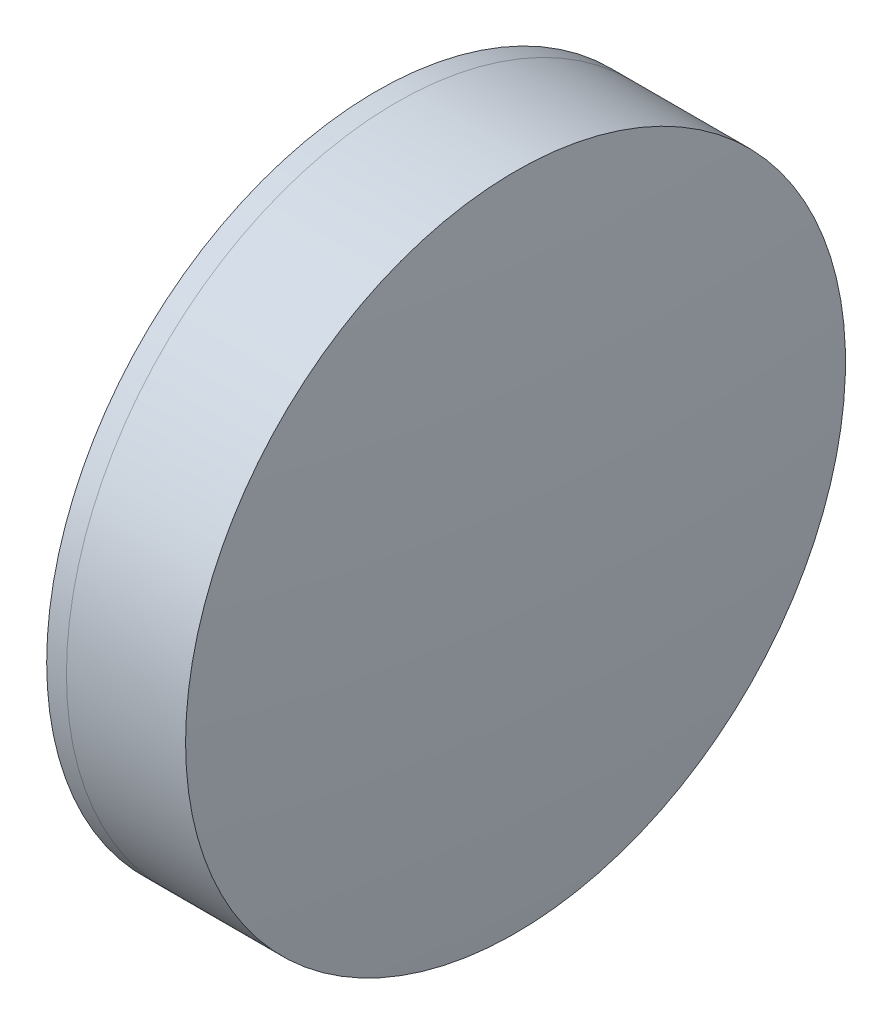
ISO-10303-21;
HEADER;
FILE_DESCRIPTION(('STEP AP214'),'2;1');
FILE_NAME('part.step','',(''),(''),'','','');
FILE_SCHEMA(('AUTOMOTIVE_DESIGN { 1 0 10303 214 1 1 1 1 }'));
ENDSEC;
DATA;
#1=APPLICATION_CONTEXT('core data for automotive mechanical design processes');
#2=APPLICATION_PROTOCOL_DEFINITION('international standard','automotive_design',2000,#1);
#3=PRODUCT_CONTEXT('',#1,'mechanical');
#4=PRODUCT('Part','Part','',(#3));
#5=PRODUCT_RELATED_PRODUCT_CATEGORY('part','',(#4));
#6=PRODUCT_DEFINITION_FORMATION('','',#4);
#7=PRODUCT_DEFINITION_CONTEXT('part definition',#1,'design');
#8=PRODUCT_DEFINITION('design','',#6,#7);
#9=PRODUCT_DEFINITION_SHAPE('','',#8);
#10=(LENGTH_UNIT() NAMED_UNIT(*) SI_UNIT(.MILLI.,.METRE.));
#11=(NAMED_UNIT(*) PLANE_ANGLE_UNIT() SI_UNIT($,.RADIAN.));
#12=(NAMED_UNIT(*) SI_UNIT($,.STERADIAN.) SOLID_ANGLE_UNIT());
#13=UNCERTAINTY_MEASURE_WITH_UNIT(LENGTH_MEASURE(1.E-05),#10,'distance_accuracy_value','');
#14=(GEOMETRIC_REPRESENTATION_CONTEXT(3) GLOBAL_UNCERTAINTY_ASSIGNED_CONTEXT((#13)) GLOBAL_UNIT_ASSIGNED_CONTEXT((#10,
#11,#12)) REPRESENTATION_CONTEXT('',''));
#15=CARTESIAN_POINT('',(0.,0.,0.));
#16=DIRECTION('',(0.,0.,1.));
#17=DIRECTION('',(1.,0.,0.));
#18=AXIS2_PLACEMENT_3D('',#15,#16,#17);
#19=CARTESIAN_POINT('',(180.900500738752,0.,0.));
#20=DIRECTION('',(-1.,0.,0.));
#21=DIRECTION('',(0.,0.,1.));
#22=AXIS2_PLACEMENT_3D('',#19,#20,#21);
#23=SPHERICAL_SURFACE('',#22,29.4000000000003);
#24=CARTESIAN_POINT('',(206.186069745599,0.,0.));
#25=DIRECTION('',(-1.,0.,0.));
#26=DIRECTION('',(0.,0.,1.));
#27=AXIS2_PLACEMENT_3D('',#24,#25,#26);
#28=CIRCLE('',#27,15.);
#29=CARTESIAN_POINT('',(206.186069745599,0.,15.));
#30=VERTEX_POINT('',#29);
#31=EDGE_CURVE('E11',#30,#30,#28,.T.);
#32=ORIENTED_EDGE('',*,*,#31,.T.);
#33=EDGE_LOOP('',(#32));
#34=FACE_BOUND('',#33,.T.);
#35=ADVANCED_FACE('F45',(#34),#23,.F.);
#36=CARTESIAN_POINT('',(-0.551919992657797,0.,0.));
#37=DIRECTION('',(-1.,0.,0.));
#38=DIRECTION('',(0.,0.,1.));
#39=AXIS2_PLACEMENT_3D('',#36,#37,#38);
#40=CYLINDRICAL_SURFACE('',#39,15.);
#41=CARTESIAN_POINT('',(211.602397493735,0.,0.));
#42=DIRECTION('',(-1.,0.,0.));
#43=DIRECTION('',(0.,0.,1.));
#44=AXIS2_PLACEMENT_3D('',#41,#42,#43);
#45=CIRCLE('',#44,15.);
#46=CARTESIAN_POINT('',(211.602397493735,0.,15.));
#47=VERTEX_POINT('',#46);
#48=EDGE_CURVE('E51',#47,#47,#45,.T.);
#49=ORIENTED_EDGE('',*,*,#48,.T.);
#50=EDGE_LOOP('',(#49));
#51=FACE_BOUND('',#50,.T.);
#52=ORIENTED_EDGE('',*,*,#31,.F.);
#53=EDGE_LOOP('',(#52));
#54=FACE_BOUND('',#53,.T.);
#55=ADVANCED_FACE('F57',(#51,#54),#40,.T.);
#56=CARTESIAN_POINT('',(50.8005007387524,0.,0.));
#57=DIRECTION('',(-1.,0.,0.));
#58=DIRECTION('',(0.,0.,1.));
#59=AXIS2_PLACEMENT_3D('',#56,#57,#58);
#60=SPHERICAL_SURFACE('',#59,161.5);
#61=ORIENTED_EDGE('',*,*,#48,.F.);
#62=EDGE_LOOP('',(#61));
#63=FACE_BOUND('',#62,.T.);
#64=ADVANCED_FACE('F60',(#63),#60,.T.);
#65=CLOSED_SHELL('',(#35,#55,#64));
#66=MANIFOLD_SOLID_BREP('B2',#65);
#67=CARTESIAN_POINT('',(235.800500738752,0.,-1.00658588862291E-13));
#68=DIRECTION('',(-1.,0.,0.));
#69=DIRECTION('',(0.,0.,1.));
#70=AXIS2_PLACEMENT_3D('',#67,#68,#69);
#71=SPHERICAL_SURFACE('',#70,34.);
#72=CARTESIAN_POINT('',(205.288208133968,0.,0.));
#73=DIRECTION('',(-1.,0.,0.));
#74=DIRECTION('',(0.,0.,1.));
#75=AXIS2_PLACEMENT_3D('',#72,#73,#74);
#76=CIRCLE('',#75,15.);
#77=CARTESIAN_POINT('',(205.288208133968,0.,15.));
#78=VERTEX_POINT('',#77);
#79=EDGE_CURVE('E44',#78,#78,#76,.T.);
#80=ORIENTED_EDGE('',*,*,#79,.T.);
#81=EDGE_LOOP('',(#80));
#82=FACE_BOUND('',#81,.T.);
#83=ADVANCED_FACE('F86',(#82),#71,.T.);
#84=CARTESIAN_POINT('',(124.523309526045,0.,0.));
#85=DIRECTION('',(-1.,0.,0.));
#86=DIRECTION('',(0.,0.,1.));
#87=AXIS2_PLACEMENT_3D('',#84,#85,#86);
#88=CYLINDRICAL_SURFACE('',#87,15.);
#89=CARTESIAN_POINT('',(206.186069745599,0.,0.));
#90=DIRECTION('',(-1.,0.,0.));
#91=DIRECTION('',(0.,0.,1.));
#92=AXIS2_PLACEMENT_3D('',#89,#90,#91);
#93=CIRCLE('',#92,15.);
#94=CARTESIAN_POINT('',(206.186069745599,0.,15.));
#95=VERTEX_POINT('',#94);
#96=EDGE_CURVE('E92',#95,#95,#93,.T.);
#97=ORIENTED_EDGE('',*,*,#96,.T.);
#98=EDGE_LOOP('',(#97));
#99=FACE_BOUND('',#98,.T.);
#100=ORIENTED_EDGE('',*,*,#79,.F.);
#101=EDGE_LOOP('',(#100));
#102=FACE_BOUND('',#101,.T.);
#103=ADVANCED_FACE('F98',(#99,#102),#88,.T.);
#104=CARTESIAN_POINT('',(180.900500738752,0.,0.));
#105=DIRECTION('',(-1.,0.,0.));
#106=DIRECTION('',(0.,0.,1.));
#107=AXIS2_PLACEMENT_3D('',#104,#105,#106);
#108=SPHERICAL_SURFACE('',#107,29.4000000000003);
#109=ORIENTED_EDGE('',*,*,#96,.F.);
#110=EDGE_LOOP('',(#109));
#111=FACE_BOUND('',#110,.T.);
#112=ADVANCED_FACE('F101',(#111),#108,.T.);
#113=CLOSED_SHELL('',(#83,#103,#112));
#114=MANIFOLD_SOLID_BREP('B6',#113);
#115=ADVANCED_BREP_SHAPE_REPRESENTATION('',(#18,#66,#114),#14);
#116=SHAPE_DEFINITION_REPRESENTATION(#9,#115);
ENDSEC;
END-ISO-10303-21;
